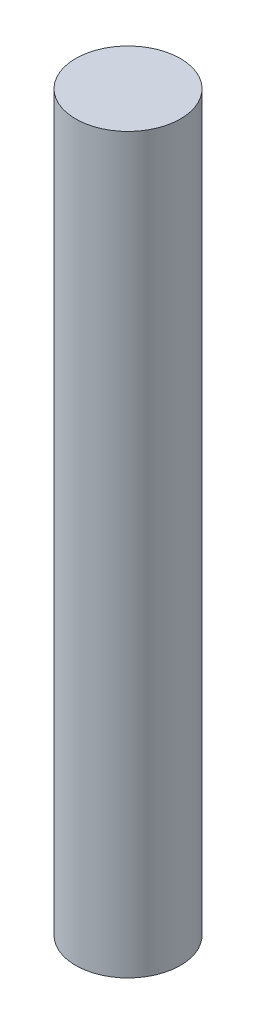
ISO-10303-21;
HEADER;
FILE_DESCRIPTION(('STEP AP214'),'2;1');
FILE_NAME('part.step','',(''),(''),'','','');
FILE_SCHEMA(('AUTOMOTIVE_DESIGN { 1 0 10303 214 1 1 1 1 }'));
ENDSEC;
DATA;
#1=APPLICATION_CONTEXT('core data for automotive mechanical design processes');
#2=APPLICATION_PROTOCOL_DEFINITION('international standard','automotive_design',2000,#1);
#3=PRODUCT_CONTEXT('',#1,'mechanical');
#4=PRODUCT('Part','Part','',(#3));
#5=PRODUCT_RELATED_PRODUCT_CATEGORY('part','',(#4));
#6=PRODUCT_DEFINITION_FORMATION('','',#4);
#7=PRODUCT_DEFINITION_CONTEXT('part definition',#1,'design');
#8=PRODUCT_DEFINITION('design','',#6,#7);
#9=PRODUCT_DEFINITION_SHAPE('','',#8);
#10=(LENGTH_UNIT() NAMED_UNIT(*) SI_UNIT(.MILLI.,.METRE.));
#11=(NAMED_UNIT(*) PLANE_ANGLE_UNIT() SI_UNIT($,.RADIAN.));
#12=(NAMED_UNIT(*) SI_UNIT($,.STERADIAN.) SOLID_ANGLE_UNIT());
#13=UNCERTAINTY_MEASURE_WITH_UNIT(LENGTH_MEASURE(1.E-05),#10,'distance_accuracy_value','');
#14=(GEOMETRIC_REPRESENTATION_CONTEXT(3) GLOBAL_UNCERTAINTY_ASSIGNED_CONTEXT((#13)) GLOBAL_UNIT_ASSIGNED_CONTEXT((#10,
#11,#12)) REPRESENTATION_CONTEXT('',''));
#15=CARTESIAN_POINT('',(0.,0.,0.));
#16=DIRECTION('',(0.,0.,1.));
#17=DIRECTION('',(1.,0.,0.));
#18=AXIS2_PLACEMENT_3D('',#15,#16,#17);
#19=CARTESIAN_POINT('',(0.,35.,0.));
#20=DIRECTION('',(0.,-1.,0.));
#21=DIRECTION('',(0.,0.,1.));
#22=AXIS2_PLACEMENT_3D('',#19,#20,#21);
#23=CYLINDRICAL_SURFACE('',#22,2.5);
#24=CARTESIAN_POINT('',(0.,35.,0.));
#25=DIRECTION('',(0.,-1.,0.));
#26=DIRECTION('',(0.,0.,-1.));
#27=AXIS2_PLACEMENT_3D('',#24,#25,#26);
#28=CIRCLE('',#27,2.5);
#29=CARTESIAN_POINT('',(0.,35.,-2.5));
#30=VERTEX_POINT('',#29);
#31=EDGE_CURVE('E10',#30,#30,#28,.T.);
#32=ORIENTED_EDGE('',*,*,#31,.T.);
#33=EDGE_LOOP('',(#32));
#34=FACE_BOUND('',#33,.T.);
#35=CARTESIAN_POINT('',(0.,0.,0.));
#36=DIRECTION('',(0.,-1.,0.));
#37=DIRECTION('',(0.,0.,-1.));
#38=AXIS2_PLACEMENT_3D('',#35,#36,#37);
#39=CIRCLE('',#38,2.5);
#40=CARTESIAN_POINT('',(0.,0.,-2.5));
#41=VERTEX_POINT('',#40);
#42=EDGE_CURVE('E36',#41,#41,#39,.T.);
#43=ORIENTED_EDGE('',*,*,#42,.F.);
#44=EDGE_LOOP('',(#43));
#45=FACE_BOUND('',#44,.T.);
#46=ADVANCED_FACE('F33',(#34,#45),#23,.T.);
#47=CARTESIAN_POINT('',(0.,35.,0.));
#48=DIRECTION('',(0.,1.,0.));
#49=DIRECTION('',(0.,0.,-1.));
#50=AXIS2_PLACEMENT_3D('',#47,#48,#49);
#51=PLANE('',#50);
#52=ORIENTED_EDGE('',*,*,#31,.F.);
#53=EDGE_LOOP('',(#52));
#54=FACE_BOUND('',#53,.T.);
#55=ADVANCED_FACE('F48',(#54),#51,.T.);
#56=CARTESIAN_POINT('',(0.,0.,0.));
#57=DIRECTION('',(0.,1.,0.));
#58=DIRECTION('',(0.,0.,-1.));
#59=AXIS2_PLACEMENT_3D('',#56,#57,#58);
#60=PLANE('',#59);
#61=ORIENTED_EDGE('',*,*,#42,.T.);
#62=EDGE_LOOP('',(#61));
#63=FACE_BOUND('',#62,.T.);
#64=ADVANCED_FACE('F45',(#63),#60,.F.);
#65=CLOSED_SHELL('',(#46,#55,#64));
#66=MANIFOLD_SOLID_BREP('B2',#65);
#67=ADVANCED_BREP_SHAPE_REPRESENTATION('',(#18,#66),#14);
#68=SHAPE_DEFINITION_REPRESENTATION(#9,#67);
ENDSEC;
END-ISO-10303-21;
